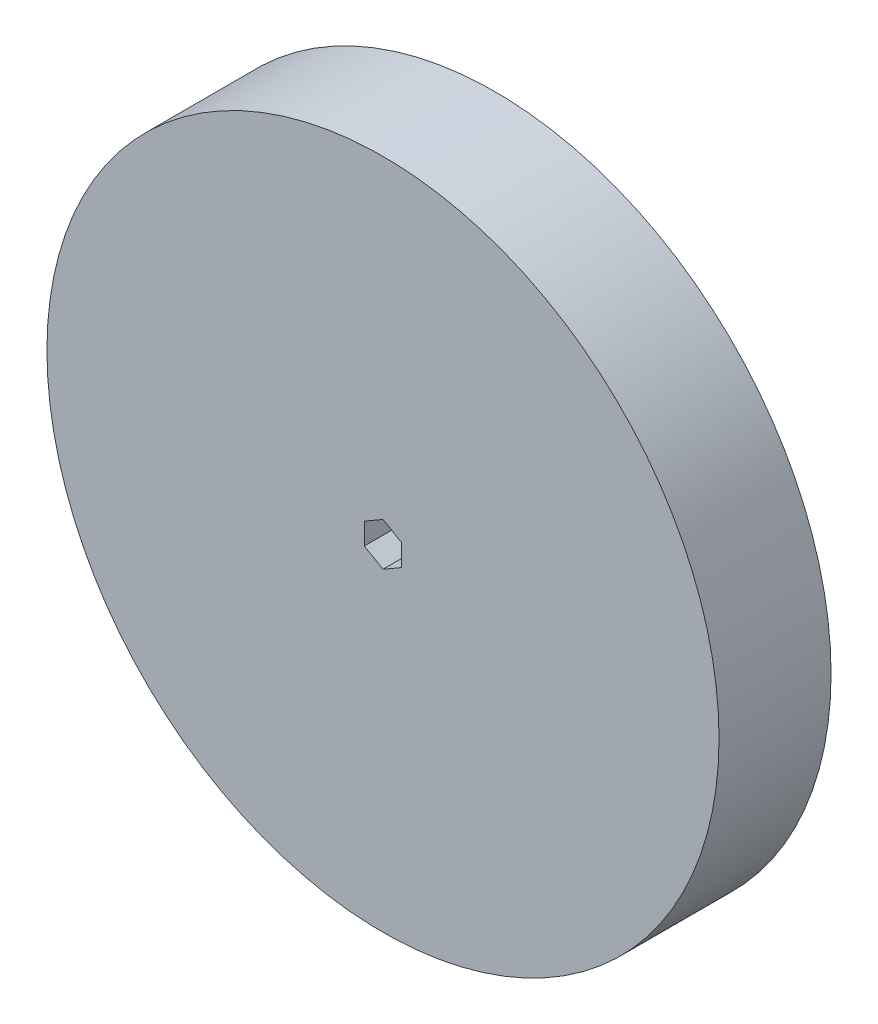
ISO-10303-21;
HEADER;
FILE_DESCRIPTION(('STEP AP214'),'2;1');
FILE_NAME('part.step','',(''),(''),'','','');
FILE_SCHEMA(('AUTOMOTIVE_DESIGN { 1 0 10303 214 1 1 1 1 }'));
ENDSEC;
DATA;
#1=APPLICATION_CONTEXT('core data for automotive mechanical design processes');
#2=APPLICATION_PROTOCOL_DEFINITION('international standard','automotive_design',2000,#1);
#3=PRODUCT_CONTEXT('',#1,'mechanical');
#4=PRODUCT('Part','Part','',(#3));
#5=PRODUCT_RELATED_PRODUCT_CATEGORY('part','',(#4));
#6=PRODUCT_DEFINITION_FORMATION('','',#4);
#7=PRODUCT_DEFINITION_CONTEXT('part definition',#1,'design');
#8=PRODUCT_DEFINITION('design','',#6,#7);
#9=PRODUCT_DEFINITION_SHAPE('','',#8);
#10=(LENGTH_UNIT() NAMED_UNIT(*) SI_UNIT(.MILLI.,.METRE.));
#11=(NAMED_UNIT(*) PLANE_ANGLE_UNIT() SI_UNIT($,.RADIAN.));
#12=(NAMED_UNIT(*) SI_UNIT($,.STERADIAN.) SOLID_ANGLE_UNIT());
#13=UNCERTAINTY_MEASURE_WITH_UNIT(LENGTH_MEASURE(1.E-05),#10,'distance_accuracy_value','');
#14=(GEOMETRIC_REPRESENTATION_CONTEXT(3) GLOBAL_UNCERTAINTY_ASSIGNED_CONTEXT((#13)) GLOBAL_UNIT_ASSIGNED_CONTEXT((#10,
#11,#12)) REPRESENTATION_CONTEXT('',''));
#15=CARTESIAN_POINT('',(0.,0.,0.));
#16=DIRECTION('',(0.,0.,1.));
#17=DIRECTION('',(1.,0.,0.));
#18=AXIS2_PLACEMENT_3D('',#15,#16,#17);
#19=CARTESIAN_POINT('',(0.,0.,19.05));
#20=DIRECTION('',(0.,0.,-1.));
#21=DIRECTION('',(-1.,0.,0.));
#22=AXIS2_PLACEMENT_3D('',#19,#20,#21);
#23=CYLINDRICAL_SURFACE('',#22,57.15);
#24=CARTESIAN_POINT('',(0.,0.,19.05));
#25=DIRECTION('',(0.,0.,1.));
#26=DIRECTION('',(1.,0.,0.));
#27=AXIS2_PLACEMENT_3D('',#24,#25,#26);
#28=CIRCLE('',#27,57.15);
#29=CARTESIAN_POINT('',(57.15,0.,19.05));
#30=VERTEX_POINT('',#29);
#31=EDGE_CURVE('E11',#30,#30,#28,.T.);
#32=ORIENTED_EDGE('',*,*,#31,.F.);
#33=EDGE_LOOP('',(#32));
#34=FACE_BOUND('',#33,.T.);
#35=CARTESIAN_POINT('',(0.,0.,0.));
#36=DIRECTION('',(0.,0.,1.));
#37=DIRECTION('',(1.,0.,0.));
#38=AXIS2_PLACEMENT_3D('',#35,#36,#37);
#39=CIRCLE('',#38,57.15);
#40=CARTESIAN_POINT('',(57.15,0.,0.));
#41=VERTEX_POINT('',#40);
#42=EDGE_CURVE('E35',#41,#41,#39,.T.);
#43=ORIENTED_EDGE('',*,*,#42,.T.);
#44=EDGE_LOOP('',(#43));
#45=FACE_BOUND('',#44,.T.);
#46=ADVANCED_FACE('F32',(#34,#45),#23,.T.);
#47=CARTESIAN_POINT('',(0.,0.,19.05));
#48=DIRECTION('',(0.,0.,1.));
#49=DIRECTION('',(1.,0.,0.));
#50=AXIS2_PLACEMENT_3D('',#47,#48,#49);
#51=PLANE('',#50);
#52=DIRECTION('',(0.866025403784439,0.5,0.));
#53=VECTOR('',#52,1.);
#54=CARTESIAN_POINT('',(-3.175,1.83308710467706,19.05));
#55=LINE('',#54,#53);
#56=CARTESIAN_POINT('',(-3.175,1.83308710467706,19.05));
#57=VERTEX_POINT('',#56);
#58=CARTESIAN_POINT('',(0.,3.66617420935413,19.05));
#59=VERTEX_POINT('',#58);
#60=EDGE_CURVE('E86',#57,#59,#55,.T.);
#61=ORIENTED_EDGE('',*,*,#60,.T.);
#62=DIRECTION('',(0.866025403784438,-0.5,0.));
#63=VECTOR('',#62,1.);
#64=CARTESIAN_POINT('',(0.,3.66617420935413,19.05));
#65=LINE('',#64,#63);
#66=CARTESIAN_POINT('',(3.175,1.83308710467706,19.05));
#67=VERTEX_POINT('',#66);
#68=EDGE_CURVE('E95',#59,#67,#65,.T.);
#69=ORIENTED_EDGE('',*,*,#68,.T.);
#70=DIRECTION('',(0.,-1.,0.));
#71=VECTOR('',#70,1.);
#72=CARTESIAN_POINT('',(3.175,1.83308710467706,19.05));
#73=LINE('',#72,#71);
#74=CARTESIAN_POINT('',(3.175,-1.83308710467706,19.05));
#75=VERTEX_POINT('',#74);
#76=EDGE_CURVE('E46',#67,#75,#73,.T.);
#77=ORIENTED_EDGE('',*,*,#76,.T.);
#78=DIRECTION('',(-0.866025403784439,-0.5,0.));
#79=VECTOR('',#78,1.);
#80=CARTESIAN_POINT('',(3.175,-1.83308710467706,19.05));
#81=LINE('',#80,#79);
#82=CARTESIAN_POINT('',(0.,-3.66617420935412,19.05));
#83=VERTEX_POINT('',#82);
#84=EDGE_CURVE('E110',#75,#83,#81,.T.);
#85=ORIENTED_EDGE('',*,*,#84,.T.);
#86=DIRECTION('',(-0.866025403784439,0.5,0.));
#87=VECTOR('',#86,1.);
#88=CARTESIAN_POINT('',(0.,-3.66617420935412,19.05));
#89=LINE('',#88,#87);
#90=CARTESIAN_POINT('',(-3.175,-1.83308710467706,19.05));
#91=VERTEX_POINT('',#90);
#92=EDGE_CURVE('E113',#83,#91,#89,.T.);
#93=ORIENTED_EDGE('',*,*,#92,.T.);
#94=DIRECTION('',(0.,1.,0.));
#95=VECTOR('',#94,1.);
#96=CARTESIAN_POINT('',(-3.175,-1.83308710467706,19.05));
#97=LINE('',#96,#95);
#98=EDGE_CURVE('E92',#91,#57,#97,.T.);
#99=ORIENTED_EDGE('',*,*,#98,.T.);
#100=EDGE_LOOP('',(#61,#69,#77,#85,#93,#99));
#101=FACE_BOUND('',#100,.T.);
#102=ORIENTED_EDGE('',*,*,#31,.T.);
#103=EDGE_LOOP('',(#102));
#104=FACE_BOUND('',#103,.T.);
#105=ADVANCED_FACE('F99',(#101,#104),#51,.T.);
#106=CARTESIAN_POINT('',(0.,0.,0.));
#107=DIRECTION('',(0.,0.,1.));
#108=DIRECTION('',(1.,0.,0.));
#109=AXIS2_PLACEMENT_3D('',#106,#107,#108);
#110=PLANE('',#109);
#111=DIRECTION('',(0.866025403784438,-0.5,0.));
#112=VECTOR('',#111,1.);
#113=CARTESIAN_POINT('',(0.,3.66617420935413,0.));
#114=LINE('',#113,#112);
#115=CARTESIAN_POINT('',(0.,3.66617420935413,0.));
#116=VERTEX_POINT('',#115);
#117=CARTESIAN_POINT('',(3.175,1.83308710467706,0.));
#118=VERTEX_POINT('',#117);
#119=EDGE_CURVE('E117',#116,#118,#114,.T.);
#120=ORIENTED_EDGE('',*,*,#119,.F.);
#121=DIRECTION('',(0.866025403784439,0.5,0.));
#122=VECTOR('',#121,1.);
#123=CARTESIAN_POINT('',(-3.175,1.83308710467706,0.));
#124=LINE('',#123,#122);
#125=CARTESIAN_POINT('',(-3.175,1.83308710467706,0.));
#126=VERTEX_POINT('',#125);
#127=EDGE_CURVE('E54',#126,#116,#124,.T.);
#128=ORIENTED_EDGE('',*,*,#127,.F.);
#129=DIRECTION('',(0.,1.,0.));
#130=VECTOR('',#129,1.);
#131=CARTESIAN_POINT('',(-3.175,-1.83308710467706,0.));
#132=LINE('',#131,#130);
#133=CARTESIAN_POINT('',(-3.175,-1.83308710467706,0.));
#134=VERTEX_POINT('',#133);
#135=EDGE_CURVE('E103',#134,#126,#132,.T.);
#136=ORIENTED_EDGE('',*,*,#135,.F.);
#137=DIRECTION('',(-0.866025403784439,0.5,0.));
#138=VECTOR('',#137,1.);
#139=CARTESIAN_POINT('',(0.,-3.66617420935412,0.));
#140=LINE('',#139,#138);
#141=CARTESIAN_POINT('',(0.,-3.66617420935412,0.));
#142=VERTEX_POINT('',#141);
#143=EDGE_CURVE('E106',#142,#134,#140,.T.);
#144=ORIENTED_EDGE('',*,*,#143,.F.);
#145=DIRECTION('',(-0.866025403784439,-0.5,0.));
#146=VECTOR('',#145,1.);
#147=CARTESIAN_POINT('',(3.175,-1.83308710467706,0.));
#148=LINE('',#147,#146);
#149=CARTESIAN_POINT('',(3.175,-1.83308710467706,0.));
#150=VERTEX_POINT('',#149);
#151=EDGE_CURVE('E122',#150,#142,#148,.T.);
#152=ORIENTED_EDGE('',*,*,#151,.F.);
#153=DIRECTION('',(0.,-1.,0.));
#154=VECTOR('',#153,1.);
#155=CARTESIAN_POINT('',(3.175,1.83308710467706,0.));
#156=LINE('',#155,#154);
#157=EDGE_CURVE('E119',#118,#150,#156,.T.);
#158=ORIENTED_EDGE('',*,*,#157,.F.);
#159=EDGE_LOOP('',(#120,#128,#136,#144,#152,#158));
#160=FACE_BOUND('',#159,.T.);
#161=ORIENTED_EDGE('',*,*,#42,.F.);
#162=EDGE_LOOP('',(#161));
#163=FACE_BOUND('',#162,.T.);
#164=ADVANCED_FACE('F139',(#160,#163),#110,.F.);
#165=CARTESIAN_POINT('',(-3.175,1.83308710467706,19.05));
#166=DIRECTION('',(-0.5,0.866025403784439,0.));
#167=DIRECTION('',(-0.866025403784439,-0.5,0.));
#168=AXIS2_PLACEMENT_3D('',#165,#166,#167);
#169=PLANE('',#168);
#170=ORIENTED_EDGE('',*,*,#127,.T.);
#171=DIRECTION('',(0.,0.,-1.));
#172=VECTOR('',#171,1.);
#173=CARTESIAN_POINT('',(0.,3.66617420935413,19.05));
#174=LINE('',#173,#172);
#175=EDGE_CURVE('E82',#59,#116,#174,.T.);
#176=ORIENTED_EDGE('',*,*,#175,.F.);
#177=ORIENTED_EDGE('',*,*,#60,.F.);
#178=DIRECTION('',(0.,0.,-1.));
#179=VECTOR('',#178,1.);
#180=CARTESIAN_POINT('',(-3.175,1.83308710467706,19.05));
#181=LINE('',#180,#179);
#182=EDGE_CURVE('E127',#57,#126,#181,.T.);
#183=ORIENTED_EDGE('',*,*,#182,.T.);
#184=EDGE_LOOP('',(#170,#176,#177,#183));
#185=FACE_BOUND('',#184,.T.);
#186=ADVANCED_FACE('F84',(#185),#169,.F.);
#187=CARTESIAN_POINT('',(-3.175,-1.83308710467706,19.05));
#188=DIRECTION('',(-1.,0.,0.));
#189=DIRECTION('',(0.,0.,1.));
#190=AXIS2_PLACEMENT_3D('',#187,#188,#189);
#191=PLANE('',#190);
#192=ORIENTED_EDGE('',*,*,#135,.T.);
#193=ORIENTED_EDGE('',*,*,#182,.F.);
#194=ORIENTED_EDGE('',*,*,#98,.F.);
#195=DIRECTION('',(0.,0.,-1.));
#196=VECTOR('',#195,1.);
#197=CARTESIAN_POINT('',(-3.175,-1.83308710467706,19.05));
#198=LINE('',#197,#196);
#199=EDGE_CURVE('E129',#91,#134,#198,.T.);
#200=ORIENTED_EDGE('',*,*,#199,.T.);
#201=EDGE_LOOP('',(#192,#193,#194,#200));
#202=FACE_BOUND('',#201,.T.);
#203=ADVANCED_FACE('F150',(#202),#191,.F.);
#204=CARTESIAN_POINT('',(0.,-3.66617420935412,19.05));
#205=DIRECTION('',(-0.5,-0.866025403784439,0.));
#206=DIRECTION('',(0.866025403784439,-0.5,0.));
#207=AXIS2_PLACEMENT_3D('',#204,#205,#206);
#208=PLANE('',#207);
#209=ORIENTED_EDGE('',*,*,#143,.T.);
#210=ORIENTED_EDGE('',*,*,#199,.F.);
#211=ORIENTED_EDGE('',*,*,#92,.F.);
#212=DIRECTION('',(0.,0.,-1.));
#213=VECTOR('',#212,1.);
#214=CARTESIAN_POINT('',(0.,-3.66617420935412,19.05));
#215=LINE('',#214,#213);
#216=EDGE_CURVE('E131',#83,#142,#215,.T.);
#217=ORIENTED_EDGE('',*,*,#216,.T.);
#218=EDGE_LOOP('',(#209,#210,#211,#217));
#219=FACE_BOUND('',#218,.T.);
#220=ADVANCED_FACE('F148',(#219),#208,.F.);
#221=CARTESIAN_POINT('',(3.175,-1.83308710467706,19.05));
#222=DIRECTION('',(0.5,-0.866025403784439,0.));
#223=DIRECTION('',(0.866025403784438,0.5,0.));
#224=AXIS2_PLACEMENT_3D('',#221,#222,#223);
#225=PLANE('',#224);
#226=ORIENTED_EDGE('',*,*,#151,.T.);
#227=ORIENTED_EDGE('',*,*,#216,.F.);
#228=ORIENTED_EDGE('',*,*,#84,.F.);
#229=DIRECTION('',(0.,0.,-1.));
#230=VECTOR('',#229,1.);
#231=CARTESIAN_POINT('',(3.175,-1.83308710467706,19.05));
#232=LINE('',#231,#230);
#233=EDGE_CURVE('E133',#75,#150,#232,.T.);
#234=ORIENTED_EDGE('',*,*,#233,.T.);
#235=EDGE_LOOP('',(#226,#227,#228,#234));
#236=FACE_BOUND('',#235,.T.);
#237=ADVANCED_FACE('F144',(#236),#225,.F.);
#238=CARTESIAN_POINT('',(3.175,1.83308710467706,19.05));
#239=DIRECTION('',(1.,0.,0.));
#240=DIRECTION('',(0.,1.,0.));
#241=AXIS2_PLACEMENT_3D('',#238,#239,#240);
#242=PLANE('',#241);
#243=ORIENTED_EDGE('',*,*,#157,.T.);
#244=ORIENTED_EDGE('',*,*,#233,.F.);
#245=ORIENTED_EDGE('',*,*,#76,.F.);
#246=DIRECTION('',(0.,0.,-1.));
#247=VECTOR('',#246,1.);
#248=CARTESIAN_POINT('',(3.175,1.83308710467706,19.05));
#249=LINE('',#248,#247);
#250=EDGE_CURVE('E91',#67,#118,#249,.T.);
#251=ORIENTED_EDGE('',*,*,#250,.T.);
#252=EDGE_LOOP('',(#243,#244,#245,#251));
#253=FACE_BOUND('',#252,.T.);
#254=ADVANCED_FACE('F135',(#253),#242,.F.);
#255=CARTESIAN_POINT('',(0.,3.66617420935413,19.05));
#256=DIRECTION('',(0.5,0.866025403784438,0.));
#257=DIRECTION('',(-0.866025403784438,0.5,0.));
#258=AXIS2_PLACEMENT_3D('',#255,#256,#257);
#259=PLANE('',#258);
#260=ORIENTED_EDGE('',*,*,#119,.T.);
#261=ORIENTED_EDGE('',*,*,#250,.F.);
#262=ORIENTED_EDGE('',*,*,#68,.F.);
#263=ORIENTED_EDGE('',*,*,#175,.T.);
#264=EDGE_LOOP('',(#260,#261,#262,#263));
#265=FACE_BOUND('',#264,.T.);
#266=ADVANCED_FACE('F96',(#265),#259,.F.);
#267=CLOSED_SHELL('',(#46,#105,#164,#186,#203,#220,#237,#254,#266));
#268=MANIFOLD_SOLID_BREP('B2',#267);
#269=ADVANCED_BREP_SHAPE_REPRESENTATION('',(#18,#268),#14);
#270=SHAPE_DEFINITION_REPRESENTATION(#9,#269);
ENDSEC;
END-ISO-10303-21;
